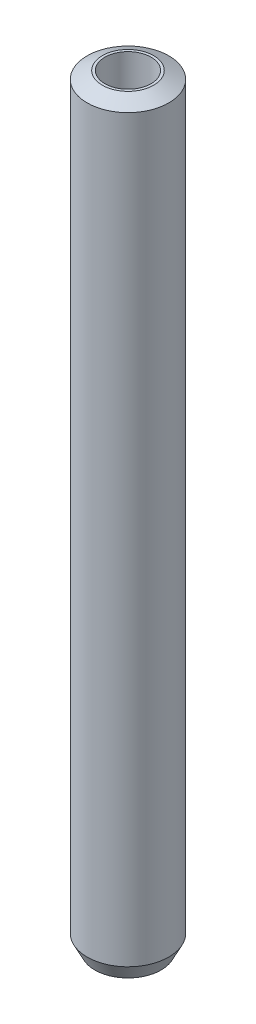
ISO-10303-21;
HEADER;
FILE_DESCRIPTION(('STEP AP214'),'2;1');
FILE_NAME('part.step','',(''),(''),'','','');
FILE_SCHEMA(('AUTOMOTIVE_DESIGN { 1 0 10303 214 1 1 1 1 }'));
ENDSEC;
DATA;
#1=APPLICATION_CONTEXT('core data for automotive mechanical design processes');
#2=APPLICATION_PROTOCOL_DEFINITION('international standard','automotive_design',2000,#1);
#3=PRODUCT_CONTEXT('',#1,'mechanical');
#4=PRODUCT('Part','Part','',(#3));
#5=PRODUCT_RELATED_PRODUCT_CATEGORY('part','',(#4));
#6=PRODUCT_DEFINITION_FORMATION('','',#4);
#7=PRODUCT_DEFINITION_CONTEXT('part definition',#1,'design');
#8=PRODUCT_DEFINITION('design','',#6,#7);
#9=PRODUCT_DEFINITION_SHAPE('','',#8);
#10=(LENGTH_UNIT() NAMED_UNIT(*) SI_UNIT(.MILLI.,.METRE.));
#11=(NAMED_UNIT(*) PLANE_ANGLE_UNIT() SI_UNIT($,.RADIAN.));
#12=(NAMED_UNIT(*) SI_UNIT($,.STERADIAN.) SOLID_ANGLE_UNIT());
#13=UNCERTAINTY_MEASURE_WITH_UNIT(LENGTH_MEASURE(1.E-05),#10,'distance_accuracy_value','');
#14=(GEOMETRIC_REPRESENTATION_CONTEXT(3) GLOBAL_UNCERTAINTY_ASSIGNED_CONTEXT((#13)) GLOBAL_UNIT_ASSIGNED_CONTEXT((#10,
#11,#12)) REPRESENTATION_CONTEXT('',''));
#15=CARTESIAN_POINT('',(0.,0.,0.));
#16=DIRECTION('',(0.,0.,1.));
#17=DIRECTION('',(1.,0.,0.));
#18=AXIS2_PLACEMENT_3D('',#15,#16,#17);
#19=CARTESIAN_POINT('',(0.,280.133795395468,0.));
#20=DIRECTION('',(0.,-1.,0.));
#21=DIRECTION('',(0.,0.,-1.));
#22=AXIS2_PLACEMENT_3D('',#19,#20,#21);
#23=CYLINDRICAL_SURFACE('',#22,15.);
#24=CARTESIAN_POINT('',(0.,277.300949299481,0.));
#25=DIRECTION('',(0.,1.,0.));
#26=DIRECTION('',(0.,0.,1.));
#27=AXIS2_PLACEMENT_3D('',#24,#25,#26);
#28=CIRCLE('',#27,15.);
#29=CARTESIAN_POINT('',(0.,277.300949299481,15.));
#30=VERTEX_POINT('',#29);
#31=EDGE_CURVE('E50',#30,#30,#28,.F.);
#32=ORIENTED_EDGE('',*,*,#31,.T.);
#33=EDGE_LOOP('',(#32));
#34=FACE_BOUND('',#33,.T.);
#35=CARTESIAN_POINT('',(0.,5.56781254546534,0.));
#36=DIRECTION('',(0.,1.,0.));
#37=DIRECTION('',(0.,0.,1.));
#38=AXIS2_PLACEMENT_3D('',#35,#36,#37);
#39=CIRCLE('',#38,15.);
#40=CARTESIAN_POINT('',(0.,5.56781254546534,15.));
#41=VERTEX_POINT('',#40);
#42=EDGE_CURVE('E51',#41,#41,#39,.T.);
#43=ORIENTED_EDGE('',*,*,#42,.T.);
#44=EDGE_LOOP('',(#43));
#45=FACE_BOUND('',#44,.T.);
#46=ADVANCED_FACE('F39',(#34,#45),#23,.T.);
#47=CARTESIAN_POINT('',(0.,280.133795395468,0.));
#48=DIRECTION('',(0.,1.,0.));
#49=DIRECTION('',(0.,0.,1.));
#50=AXIS2_PLACEMENT_3D('',#47,#48,#49);
#51=PLANE('',#50);
#52=CARTESIAN_POINT('',(0.,280.133795395468,0.));
#53=DIRECTION('',(0.,1.,0.));
#54=DIRECTION('',(0.,0.,1.));
#55=AXIS2_PLACEMENT_3D('',#52,#53,#54);
#56=CIRCLE('',#55,9.43218745453478);
#57=CARTESIAN_POINT('',(0.,280.133795395468,9.43218745453478));
#58=VERTEX_POINT('',#57);
#59=EDGE_CURVE('E54',#58,#58,#56,.T.);
#60=ORIENTED_EDGE('',*,*,#59,.T.);
#61=EDGE_LOOP('',(#60));
#62=FACE_BOUND('',#61,.T.);
#63=CARTESIAN_POINT('',(0.,280.133795395468,0.));
#64=DIRECTION('',(0.,1.,0.));
#65=DIRECTION('',(0.,0.,1.));
#66=AXIS2_PLACEMENT_3D('',#63,#64,#65);
#67=CIRCLE('',#66,8.47555156571143);
#68=CARTESIAN_POINT('',(0.,280.133795395468,8.47555156571143));
#69=VERTEX_POINT('',#68);
#70=EDGE_CURVE('E58',#69,#69,#67,.T.);
#71=ORIENTED_EDGE('',*,*,#70,.F.);
#72=EDGE_LOOP('',(#71));
#73=FACE_BOUND('',#72,.T.);
#74=ADVANCED_FACE('F69',(#62,#73),#51,.T.);
#75=CARTESIAN_POINT('',(0.,0.,0.));
#76=DIRECTION('',(0.,1.,0.));
#77=DIRECTION('',(0.,0.,1.));
#78=AXIS2_PLACEMENT_3D('',#75,#76,#77);
#79=PLANE('',#78);
#80=CARTESIAN_POINT('',(0.,0.,0.));
#81=DIRECTION('',(0.,1.,0.));
#82=DIRECTION('',(0.,0.,1.));
#83=AXIS2_PLACEMENT_3D('',#80,#81,#82);
#84=CIRCLE('',#83,12.1671539040123);
#85=CARTESIAN_POINT('',(0.,0.,12.1671539040123));
#86=VERTEX_POINT('',#85);
#87=EDGE_CURVE('E10',#86,#86,#84,.F.);
#88=ORIENTED_EDGE('',*,*,#87,.T.);
#89=EDGE_LOOP('',(#88));
#90=FACE_BOUND('',#89,.T.);
#91=CARTESIAN_POINT('',(0.,0.,0.));
#92=DIRECTION('',(0.,1.,0.));
#93=DIRECTION('',(0.,0.,1.));
#94=AXIS2_PLACEMENT_3D('',#91,#92,#93);
#95=CIRCLE('',#94,8.47555156571143);
#96=CARTESIAN_POINT('',(0.,0.,8.47555156571143));
#97=VERTEX_POINT('',#96);
#98=EDGE_CURVE('E63',#97,#97,#95,.T.);
#99=ORIENTED_EDGE('',*,*,#98,.T.);
#100=EDGE_LOOP('',(#99));
#101=FACE_BOUND('',#100,.T.);
#102=ADVANCED_FACE('F75',(#90,#101),#79,.F.);
#103=CARTESIAN_POINT('',(0.,280.133795395468,0.));
#104=DIRECTION('',(0.,-1.,0.));
#105=DIRECTION('',(0.,0.,-1.));
#106=AXIS2_PLACEMENT_3D('',#103,#104,#105);
#107=CYLINDRICAL_SURFACE('',#106,8.47555156571143);
#108=ORIENTED_EDGE('',*,*,#70,.T.);
#109=EDGE_LOOP('',(#108));
#110=FACE_BOUND('',#109,.T.);
#111=ORIENTED_EDGE('',*,*,#98,.F.);
#112=EDGE_LOOP('',(#111));
#113=FACE_BOUND('',#112,.T.);
#114=ADVANCED_FACE('F70',(#110,#113),#107,.F.);
#115=CARTESIAN_POINT('',(0.,280.133795395468,0.));
#116=DIRECTION('',(0.,-1.,0.));
#117=DIRECTION('',(0.,0.,-1.));
#118=AXIS2_PLACEMENT_3D('',#115,#116,#117);
#119=CONICAL_SURFACE('',#118,9.43218745453478,1.10014164856916);
#120=ORIENTED_EDGE('',*,*,#31,.F.);
#121=EDGE_LOOP('',(#120));
#122=FACE_BOUND('',#121,.T.);
#123=ORIENTED_EDGE('',*,*,#59,.F.);
#124=EDGE_LOOP('',(#123));
#125=FACE_BOUND('',#124,.T.);
#126=ADVANCED_FACE('F81',(#122,#125),#119,.T.);
#127=CARTESIAN_POINT('',(0.,5.56781254546534,0.));
#128=DIRECTION('',(0.,1.,0.));
#129=DIRECTION('',(0.,0.,1.));
#130=AXIS2_PLACEMENT_3D('',#127,#128,#129);
#131=CONICAL_SURFACE('',#130,15.,0.470654678225741);
#132=ORIENTED_EDGE('',*,*,#87,.F.);
#133=EDGE_LOOP('',(#132));
#134=FACE_BOUND('',#133,.T.);
#135=ORIENTED_EDGE('',*,*,#42,.F.);
#136=EDGE_LOOP('',(#135));
#137=FACE_BOUND('',#136,.T.);
#138=ADVANCED_FACE('F45',(#134,#137),#131,.T.);
#139=CLOSED_SHELL('',(#46,#74,#102,#114,#126,#138));
#140=MANIFOLD_SOLID_BREP('B2',#139);
#141=ADVANCED_BREP_SHAPE_REPRESENTATION('',(#18,#140),#14);
#142=SHAPE_DEFINITION_REPRESENTATION(#9,#141);
ENDSEC;
END-ISO-10303-21;
